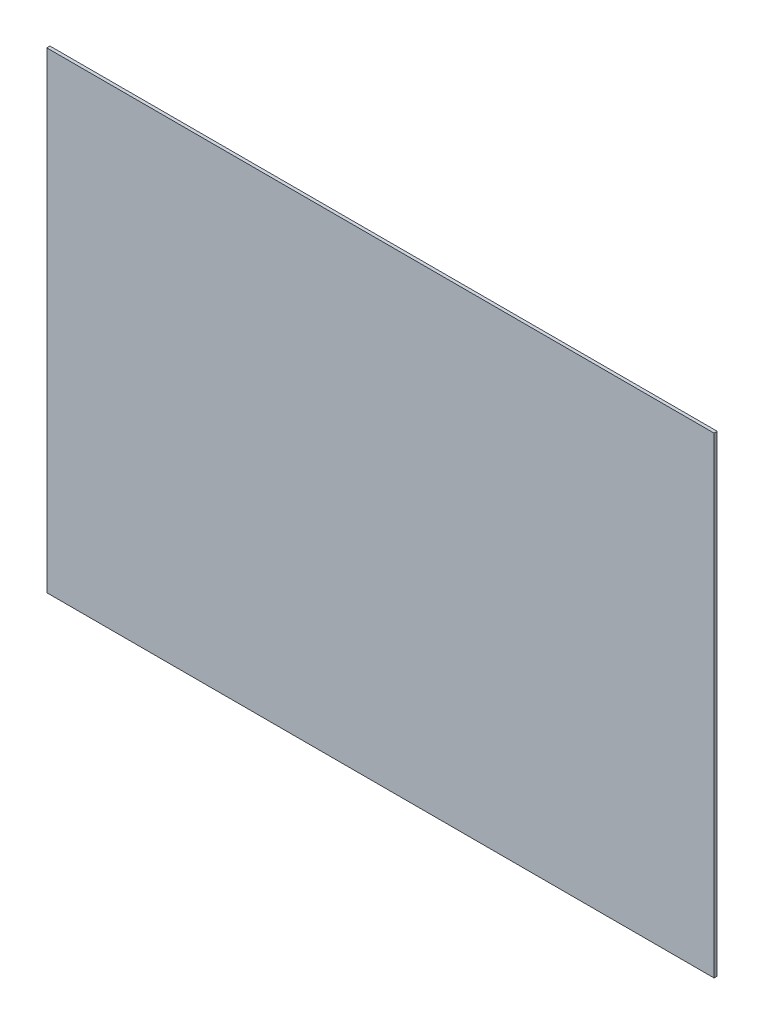
ISO-10303-21;
HEADER;
FILE_DESCRIPTION(('STEP AP214'),'2;1');
FILE_NAME('part.step','',(''),(''),'','','');
FILE_SCHEMA(('AUTOMOTIVE_DESIGN { 1 0 10303 214 1 1 1 1 }'));
ENDSEC;
DATA;
#1=APPLICATION_CONTEXT('core data for automotive mechanical design processes');
#2=APPLICATION_PROTOCOL_DEFINITION('international standard','automotive_design',2000,#1);
#3=PRODUCT_CONTEXT('',#1,'mechanical');
#4=PRODUCT('Part','Part','',(#3));
#5=PRODUCT_RELATED_PRODUCT_CATEGORY('part','',(#4));
#6=PRODUCT_DEFINITION_FORMATION('','',#4);
#7=PRODUCT_DEFINITION_CONTEXT('part definition',#1,'design');
#8=PRODUCT_DEFINITION('design','',#6,#7);
#9=PRODUCT_DEFINITION_SHAPE('','',#8);
#10=(LENGTH_UNIT() NAMED_UNIT(*) SI_UNIT(.MILLI.,.METRE.));
#11=(NAMED_UNIT(*) PLANE_ANGLE_UNIT() SI_UNIT($,.RADIAN.));
#12=(NAMED_UNIT(*) SI_UNIT($,.STERADIAN.) SOLID_ANGLE_UNIT());
#13=UNCERTAINTY_MEASURE_WITH_UNIT(LENGTH_MEASURE(1.E-05),#10,'distance_accuracy_value','');
#14=(GEOMETRIC_REPRESENTATION_CONTEXT(3) GLOBAL_UNCERTAINTY_ASSIGNED_CONTEXT((#13)) GLOBAL_UNIT_ASSIGNED_CONTEXT((#10,
#11,#12)) REPRESENTATION_CONTEXT('',''));
#15=CARTESIAN_POINT('',(0.,0.,0.));
#16=DIRECTION('',(0.,0.,1.));
#17=DIRECTION('',(1.,0.,0.));
#18=AXIS2_PLACEMENT_3D('',#15,#16,#17);
#19=CARTESIAN_POINT('',(0.,0.,2.));
#20=DIRECTION('',(1.,0.,0.));
#21=DIRECTION('',(0.,0.,-1.));
#22=AXIS2_PLACEMENT_3D('',#19,#20,#21);
#23=PLANE('',#22);
#24=DIRECTION('',(0.,-1.,0.));
#25=VECTOR('',#24,1.);
#26=CARTESIAN_POINT('',(0.,0.,0.));
#27=LINE('',#26,#25);
#28=CARTESIAN_POINT('',(0.,297.,0.));
#29=VERTEX_POINT('',#28);
#30=CARTESIAN_POINT('',(0.,0.,0.));
#31=VERTEX_POINT('',#30);
#32=EDGE_CURVE('E105',#29,#31,#27,.T.);
#33=ORIENTED_EDGE('',*,*,#32,.T.);
#34=DIRECTION('',(0.,0.,-1.));
#35=VECTOR('',#34,1.);
#36=CARTESIAN_POINT('',(0.,0.,2.));
#37=LINE('',#36,#35);
#38=CARTESIAN_POINT('',(0.,0.,2.));
#39=VERTEX_POINT('',#38);
#40=EDGE_CURVE('E11',#39,#31,#37,.T.);
#41=ORIENTED_EDGE('',*,*,#40,.F.);
#42=DIRECTION('',(0.,-1.,0.));
#43=VECTOR('',#42,1.);
#44=CARTESIAN_POINT('',(0.,0.,2.));
#45=LINE('',#44,#43);
#46=CARTESIAN_POINT('',(0.,297.,2.));
#47=VERTEX_POINT('',#46);
#48=EDGE_CURVE('E93',#47,#39,#45,.T.);
#49=ORIENTED_EDGE('',*,*,#48,.F.);
#50=DIRECTION('',(0.,0.,-1.));
#51=VECTOR('',#50,1.);
#52=CARTESIAN_POINT('',(0.,297.,2.));
#53=LINE('',#52,#51);
#54=EDGE_CURVE('E101',#47,#29,#53,.T.);
#55=ORIENTED_EDGE('',*,*,#54,.T.);
#56=EDGE_LOOP('',(#33,#41,#49,#55));
#57=FACE_BOUND('',#56,.T.);
#58=ADVANCED_FACE('F42',(#57),#23,.F.);
#59=CARTESIAN_POINT('',(0.,0.,2.));
#60=DIRECTION('',(0.,1.,0.));
#61=DIRECTION('',(0.,0.,1.));
#62=AXIS2_PLACEMENT_3D('',#59,#60,#61);
#63=PLANE('',#62);
#64=DIRECTION('',(1.,0.,0.));
#65=VECTOR('',#64,1.);
#66=CARTESIAN_POINT('',(0.,0.,0.));
#67=LINE('',#66,#65);
#68=CARTESIAN_POINT('',(420.,0.,0.));
#69=VERTEX_POINT('',#68);
#70=EDGE_CURVE('E97',#31,#69,#67,.T.);
#71=ORIENTED_EDGE('',*,*,#70,.T.);
#72=DIRECTION('',(0.,0.,-1.));
#73=VECTOR('',#72,1.);
#74=CARTESIAN_POINT('',(420.,0.,2.));
#75=LINE('',#74,#73);
#76=CARTESIAN_POINT('',(420.,0.,2.));
#77=VERTEX_POINT('',#76);
#78=EDGE_CURVE('E50',#77,#69,#75,.T.);
#79=ORIENTED_EDGE('',*,*,#78,.F.);
#80=DIRECTION('',(1.,0.,0.));
#81=VECTOR('',#80,1.);
#82=CARTESIAN_POINT('',(0.,0.,2.));
#83=LINE('',#82,#81);
#84=EDGE_CURVE('E88',#39,#77,#83,.T.);
#85=ORIENTED_EDGE('',*,*,#84,.F.);
#86=ORIENTED_EDGE('',*,*,#40,.T.);
#87=EDGE_LOOP('',(#71,#79,#85,#86));
#88=FACE_BOUND('',#87,.T.);
#89=ADVANCED_FACE('F96',(#88),#63,.F.);
#90=CARTESIAN_POINT('',(420.,0.,2.));
#91=DIRECTION('',(-1.,0.,0.));
#92=DIRECTION('',(0.,0.,1.));
#93=AXIS2_PLACEMENT_3D('',#90,#91,#92);
#94=PLANE('',#93);
#95=DIRECTION('',(0.,1.,0.));
#96=VECTOR('',#95,1.);
#97=CARTESIAN_POINT('',(420.,0.,0.));
#98=LINE('',#97,#96);
#99=CARTESIAN_POINT('',(420.,297.,0.));
#100=VERTEX_POINT('',#99);
#101=EDGE_CURVE('E75',#69,#100,#98,.T.);
#102=ORIENTED_EDGE('',*,*,#101,.T.);
#103=DIRECTION('',(0.,0.,-1.));
#104=VECTOR('',#103,1.);
#105=CARTESIAN_POINT('',(420.,297.,2.));
#106=LINE('',#105,#104);
#107=CARTESIAN_POINT('',(420.,297.,2.));
#108=VERTEX_POINT('',#107);
#109=EDGE_CURVE('E98',#108,#100,#106,.T.);
#110=ORIENTED_EDGE('',*,*,#109,.F.);
#111=DIRECTION('',(0.,1.,0.));
#112=VECTOR('',#111,1.);
#113=CARTESIAN_POINT('',(420.,0.,2.));
#114=LINE('',#113,#112);
#115=EDGE_CURVE('E91',#77,#108,#114,.T.);
#116=ORIENTED_EDGE('',*,*,#115,.F.);
#117=ORIENTED_EDGE('',*,*,#78,.T.);
#118=EDGE_LOOP('',(#102,#110,#116,#117));
#119=FACE_BOUND('',#118,.T.);
#120=ADVANCED_FACE('F99',(#119),#94,.F.);
#121=CARTESIAN_POINT('',(0.,297.,2.));
#122=DIRECTION('',(0.,-1.,0.));
#123=DIRECTION('',(0.,0.,-1.));
#124=AXIS2_PLACEMENT_3D('',#121,#122,#123);
#125=PLANE('',#124);
#126=DIRECTION('',(-1.,0.,0.));
#127=VECTOR('',#126,1.);
#128=CARTESIAN_POINT('',(0.,297.,0.));
#129=LINE('',#128,#127);
#130=EDGE_CURVE('E81',#100,#29,#129,.T.);
#131=ORIENTED_EDGE('',*,*,#130,.T.);
#132=ORIENTED_EDGE('',*,*,#54,.F.);
#133=DIRECTION('',(-1.,0.,0.));
#134=VECTOR('',#133,1.);
#135=CARTESIAN_POINT('',(0.,297.,2.));
#136=LINE('',#135,#134);
#137=EDGE_CURVE('E58',#108,#47,#136,.T.);
#138=ORIENTED_EDGE('',*,*,#137,.F.);
#139=ORIENTED_EDGE('',*,*,#109,.T.);
#140=EDGE_LOOP('',(#131,#132,#138,#139));
#141=FACE_BOUND('',#140,.T.);
#142=ADVANCED_FACE('F112',(#141),#125,.F.);
#143=CARTESIAN_POINT('',(0.,0.,2.));
#144=DIRECTION('',(0.,0.,-1.));
#145=DIRECTION('',(-1.,0.,0.));
#146=AXIS2_PLACEMENT_3D('',#143,#144,#145);
#147=PLANE('',#146);
#148=ORIENTED_EDGE('',*,*,#48,.T.);
#149=ORIENTED_EDGE('',*,*,#84,.T.);
#150=ORIENTED_EDGE('',*,*,#115,.T.);
#151=ORIENTED_EDGE('',*,*,#137,.T.);
#152=EDGE_LOOP('',(#148,#149,#150,#151));
#153=FACE_BOUND('',#152,.T.);
#154=ADVANCED_FACE('F89',(#153),#147,.F.);
#155=CARTESIAN_POINT('',(0.,0.,0.));
#156=DIRECTION('',(0.,0.,-1.));
#157=DIRECTION('',(-1.,0.,0.));
#158=AXIS2_PLACEMENT_3D('',#155,#156,#157);
#159=PLANE('',#158);
#160=ORIENTED_EDGE('',*,*,#32,.F.);
#161=ORIENTED_EDGE('',*,*,#130,.F.);
#162=ORIENTED_EDGE('',*,*,#101,.F.);
#163=ORIENTED_EDGE('',*,*,#70,.F.);
#164=EDGE_LOOP('',(#160,#161,#162,#163));
#165=FACE_BOUND('',#164,.T.);
#166=ADVANCED_FACE('F115',(#165),#159,.T.);
#167=CLOSED_SHELL('',(#58,#89,#120,#142,#154,#166));
#168=MANIFOLD_SOLID_BREP('B2',#167);
#169=ADVANCED_BREP_SHAPE_REPRESENTATION('',(#18,#168),#14);
#170=SHAPE_DEFINITION_REPRESENTATION(#9,#169);
ENDSEC;
END-ISO-10303-21;
